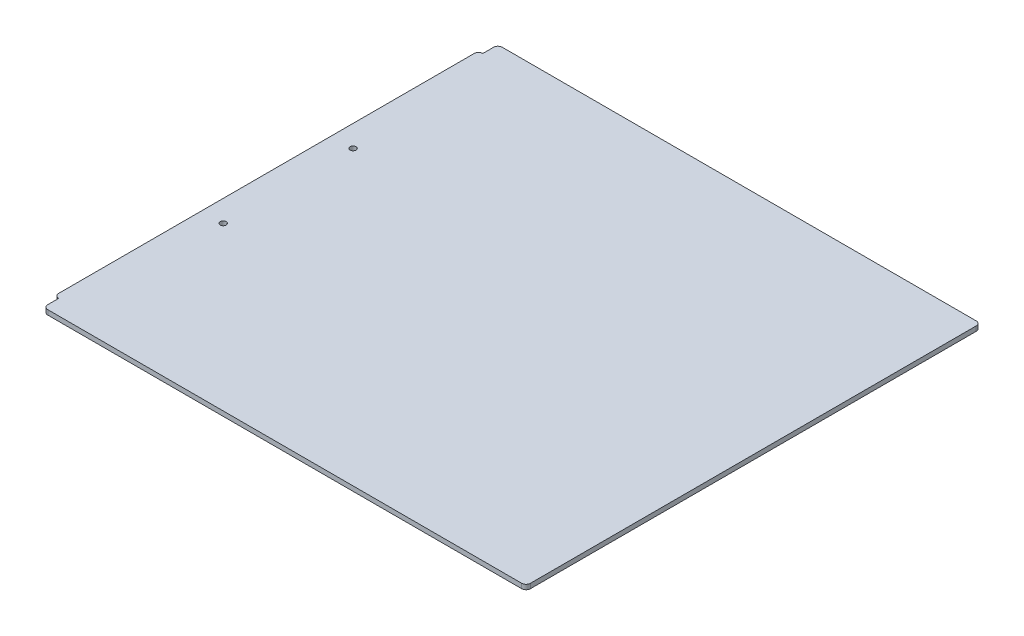
ISO-10303-21;
HEADER;
FILE_DESCRIPTION(('STEP AP214'),'2;1');
FILE_NAME('part.step','',(''),(''),'','','');
FILE_SCHEMA(('AUTOMOTIVE_DESIGN { 1 0 10303 214 1 1 1 1 }'));
ENDSEC;
DATA;
#1=APPLICATION_CONTEXT('core data for automotive mechanical design processes');
#2=APPLICATION_PROTOCOL_DEFINITION('international standard','automotive_design',2000,#1);
#3=PRODUCT_CONTEXT('',#1,'mechanical');
#4=PRODUCT('Part','Part','',(#3));
#5=PRODUCT_RELATED_PRODUCT_CATEGORY('part','',(#4));
#6=PRODUCT_DEFINITION_FORMATION('','',#4);
#7=PRODUCT_DEFINITION_CONTEXT('part definition',#1,'design');
#8=PRODUCT_DEFINITION('design','',#6,#7);
#9=PRODUCT_DEFINITION_SHAPE('','',#8);
#10=(LENGTH_UNIT() NAMED_UNIT(*) SI_UNIT(.MILLI.,.METRE.));
#11=(NAMED_UNIT(*) PLANE_ANGLE_UNIT() SI_UNIT($,.RADIAN.));
#12=(NAMED_UNIT(*) SI_UNIT($,.STERADIAN.) SOLID_ANGLE_UNIT());
#13=UNCERTAINTY_MEASURE_WITH_UNIT(LENGTH_MEASURE(1.E-05),#10,'distance_accuracy_value','');
#14=(GEOMETRIC_REPRESENTATION_CONTEXT(3) GLOBAL_UNCERTAINTY_ASSIGNED_CONTEXT((#13)) GLOBAL_UNIT_ASSIGNED_CONTEXT((#10,
#11,#12)) REPRESENTATION_CONTEXT('',''));
#15=CARTESIAN_POINT('',(0.,0.,0.));
#16=DIRECTION('',(0.,0.,1.));
#17=DIRECTION('',(1.,0.,0.));
#18=AXIS2_PLACEMENT_3D('',#15,#16,#17);
#19=CARTESIAN_POINT('',(0.,2.778125,0.));
#20=DIRECTION('',(1.,0.,0.));
#21=DIRECTION('',(0.,0.,-1.));
#22=AXIS2_PLACEMENT_3D('',#19,#20,#21);
#23=PLANE('',#22);
#24=DIRECTION('',(0.,0.,1.));
#25=VECTOR('',#24,1.);
#26=CARTESIAN_POINT('',(0.,2.778125,0.));
#27=LINE('',#26,#25);
#28=CARTESIAN_POINT('',(0.,2.778125,-274.32));
#29=VERTEX_POINT('',#28);
#30=CARTESIAN_POINT('',(0.,2.778125,-30.48));
#31=VERTEX_POINT('',#30);
#32=EDGE_CURVE('E188',#29,#31,#27,.T.);
#33=ORIENTED_EDGE('',*,*,#32,.F.);
#34=DIRECTION('',(0.,1.,0.));
#35=VECTOR('',#34,1.);
#36=CARTESIAN_POINT('',(0.,2.778125,-274.32));
#37=LINE('',#36,#35);
#38=CARTESIAN_POINT('',(0.,0.,-274.32));
#39=VERTEX_POINT('',#38);
#40=EDGE_CURVE('E206',#29,#39,#37,.F.);
#41=ORIENTED_EDGE('',*,*,#40,.T.);
#42=DIRECTION('',(0.,0.,1.));
#43=VECTOR('',#42,1.);
#44=CARTESIAN_POINT('',(0.,0.,0.));
#45=LINE('',#44,#43);
#46=CARTESIAN_POINT('',(0.,0.,-30.48));
#47=VERTEX_POINT('',#46);
#48=EDGE_CURVE('E130',#39,#47,#45,.T.);
#49=ORIENTED_EDGE('',*,*,#48,.T.);
#50=DIRECTION('',(0.,1.,0.));
#51=VECTOR('',#50,1.);
#52=CARTESIAN_POINT('',(0.,2.778125,-30.48));
#53=LINE('',#52,#51);
#54=EDGE_CURVE('E203',#47,#31,#53,.T.);
#55=ORIENTED_EDGE('',*,*,#54,.T.);
#56=EDGE_LOOP('',(#33,#41,#49,#55));
#57=FACE_BOUND('',#56,.T.);
#58=ADVANCED_FACE('F33',(#57),#23,.F.);
#59=CARTESIAN_POINT('',(0.,2.778125,0.));
#60=DIRECTION('',(0.,-1.,0.));
#61=DIRECTION('',(0.,0.,-1.));
#62=AXIS2_PLACEMENT_3D('',#59,#60,#61);
#63=PLANE('',#62);
#64=CARTESIAN_POINT('',(12.7,2.778125,-190.5762));
#65=DIRECTION('',(0.,1.,0.));
#66=DIRECTION('',(0.,0.,1.));
#67=AXIS2_PLACEMENT_3D('',#64,#65,#66);
#68=CIRCLE('',#67,1.7526);
#69=CARTESIAN_POINT('',(12.7,2.778125,-188.8236));
#70=VERTEX_POINT('',#69);
#71=EDGE_CURVE('E171',#70,#70,#68,.T.);
#72=ORIENTED_EDGE('',*,*,#71,.F.);
#73=EDGE_LOOP('',(#72));
#74=FACE_BOUND('',#73,.T.);
#75=CARTESIAN_POINT('',(12.7,2.778125,-114.3762));
#76=DIRECTION('',(0.,1.,0.));
#77=DIRECTION('',(0.,0.,1.));
#78=AXIS2_PLACEMENT_3D('',#75,#76,#77);
#79=CIRCLE('',#78,1.7526);
#80=CARTESIAN_POINT('',(12.7,2.778125,-112.6236));
#81=VERTEX_POINT('',#80);
#82=EDGE_CURVE('E165',#81,#81,#79,.T.);
#83=ORIENTED_EDGE('',*,*,#82,.F.);
#84=EDGE_LOOP('',(#83));
#85=FACE_BOUND('',#84,.T.);
#86=DIRECTION('',(0.,0.,-1.));
#87=VECTOR('',#86,1.);
#88=CARTESIAN_POINT('',(2.54,2.778125,-285.75));
#89=LINE('',#88,#87);
#90=CARTESIAN_POINT('',(2.54,2.778125,-276.86));
#91=VERTEX_POINT('',#90);
#92=CARTESIAN_POINT('',(2.54,2.778125,-283.21));
#93=VERTEX_POINT('',#92);
#94=EDGE_CURVE('E145',#91,#93,#89,.T.);
#95=ORIENTED_EDGE('',*,*,#94,.F.);
#96=CARTESIAN_POINT('',(2.54,2.778125,-274.32));
#97=DIRECTION('',(0.,-1.,0.));
#98=DIRECTION('',(0.,0.,-1.));
#99=AXIS2_PLACEMENT_3D('',#96,#97,#98);
#100=CIRCLE('',#99,2.54);
#101=EDGE_CURVE('E148',#91,#29,#100,.F.);
#102=ORIENTED_EDGE('',*,*,#101,.T.);
#103=ORIENTED_EDGE('',*,*,#32,.T.);
#104=CARTESIAN_POINT('',(2.54,2.778125,-30.48));
#105=DIRECTION('',(0.,-1.,0.));
#106=DIRECTION('',(0.,0.,-1.));
#107=AXIS2_PLACEMENT_3D('',#104,#105,#106);
#108=CIRCLE('',#107,2.54);
#109=CARTESIAN_POINT('',(2.54000000000003,2.778125,-27.94));
#110=VERTEX_POINT('',#109);
#111=EDGE_CURVE('E196',#31,#110,#108,.F.);
#112=ORIENTED_EDGE('',*,*,#111,.T.);
#113=DIRECTION('',(0.,0.,-1.));
#114=VECTOR('',#113,1.);
#115=CARTESIAN_POINT('',(2.54,2.778125,-19.05));
#116=LINE('',#115,#114);
#117=CARTESIAN_POINT('',(2.54000000000001,2.778125,-21.59));
#118=VERTEX_POINT('',#117);
#119=EDGE_CURVE('E159',#118,#110,#116,.T.);
#120=ORIENTED_EDGE('',*,*,#119,.F.);
#121=CARTESIAN_POINT('',(5.08000000000001,2.778125,-21.59));
#122=DIRECTION('',(0.,-1.,0.));
#123=DIRECTION('',(0.,0.,-1.));
#124=AXIS2_PLACEMENT_3D('',#121,#122,#123);
#125=CIRCLE('',#124,2.54);
#126=CARTESIAN_POINT('',(5.08000000000001,2.778125,-19.05));
#127=VERTEX_POINT('',#126);
#128=EDGE_CURVE('E198',#118,#127,#125,.F.);
#129=ORIENTED_EDGE('',*,*,#128,.T.);
#130=DIRECTION('',(-1.,0.,0.));
#131=VECTOR('',#130,1.);
#132=CARTESIAN_POINT('',(0.,2.778125,-19.05));
#133=LINE('',#132,#131);
#134=CARTESIAN_POINT('',(283.21,2.778125,-19.05));
#135=VERTEX_POINT('',#134);
#136=EDGE_CURVE('E181',#135,#127,#133,.T.);
#137=ORIENTED_EDGE('',*,*,#136,.F.);
#138=CARTESIAN_POINT('',(283.21,2.778125,-21.59));
#139=DIRECTION('',(0.,-1.,0.));
#140=DIRECTION('',(0.,0.,-1.));
#141=AXIS2_PLACEMENT_3D('',#138,#139,#140);
#142=CIRCLE('',#141,2.54);
#143=CARTESIAN_POINT('',(285.75,2.778125,-21.59));
#144=VERTEX_POINT('',#143);
#145=EDGE_CURVE('E194',#135,#144,#142,.F.);
#146=ORIENTED_EDGE('',*,*,#145,.T.);
#147=DIRECTION('',(0.,0.,1.));
#148=VECTOR('',#147,1.);
#149=CARTESIAN_POINT('',(285.75,2.778125,-285.75));
#150=LINE('',#149,#148);
#151=CARTESIAN_POINT('',(285.75,2.778125,-283.21));
#152=VERTEX_POINT('',#151);
#153=EDGE_CURVE('E149',#152,#144,#150,.T.);
#154=ORIENTED_EDGE('',*,*,#153,.F.);
#155=CARTESIAN_POINT('',(283.21,2.778125,-283.21));
#156=DIRECTION('',(0.,-1.,0.));
#157=DIRECTION('',(0.,0.,-1.));
#158=AXIS2_PLACEMENT_3D('',#155,#156,#157);
#159=CIRCLE('',#158,2.54);
#160=CARTESIAN_POINT('',(283.21,2.778125,-285.75));
#161=VERTEX_POINT('',#160);
#162=EDGE_CURVE('E191',#152,#161,#159,.F.);
#163=ORIENTED_EDGE('',*,*,#162,.T.);
#164=DIRECTION('',(1.,0.,0.));
#165=VECTOR('',#164,1.);
#166=CARTESIAN_POINT('',(0.,2.778125,-285.75));
#167=LINE('',#166,#165);
#168=CARTESIAN_POINT('',(5.08,2.778125,-285.75));
#169=VERTEX_POINT('',#168);
#170=EDGE_CURVE('E170',#169,#161,#167,.T.);
#171=ORIENTED_EDGE('',*,*,#170,.F.);
#172=CARTESIAN_POINT('',(5.08,2.778125,-283.21));
#173=DIRECTION('',(0.,-1.,0.));
#174=DIRECTION('',(0.,0.,-1.));
#175=AXIS2_PLACEMENT_3D('',#172,#173,#174);
#176=CIRCLE('',#175,2.54);
#177=EDGE_CURVE('E200',#169,#93,#176,.F.);
#178=ORIENTED_EDGE('',*,*,#177,.T.);
#179=EDGE_LOOP('',(#95,#102,#103,#112,#120,#129,#137,#146,#154,#163,#171,#178));
#180=FACE_BOUND('',#179,.T.);
#181=ADVANCED_FACE('F237',(#74,#85,#180),#63,.F.);
#182=CARTESIAN_POINT('',(0.,0.,0.));
#183=DIRECTION('',(0.,-1.,0.));
#184=DIRECTION('',(0.,0.,-1.));
#185=AXIS2_PLACEMENT_3D('',#182,#183,#184);
#186=PLANE('',#185);
#187=ORIENTED_EDGE('',*,*,#48,.F.);
#188=CARTESIAN_POINT('',(2.54,0.,-274.32));
#189=DIRECTION('',(0.,-1.,0.));
#190=DIRECTION('',(0.,0.,-1.));
#191=AXIS2_PLACEMENT_3D('',#188,#189,#190);
#192=CIRCLE('',#191,2.54);
#193=CARTESIAN_POINT('',(2.54,0.,-276.86));
#194=VERTEX_POINT('',#193);
#195=EDGE_CURVE('E123',#39,#194,#192,.T.);
#196=ORIENTED_EDGE('',*,*,#195,.T.);
#197=DIRECTION('',(0.,0.,-1.));
#198=VECTOR('',#197,1.);
#199=CARTESIAN_POINT('',(2.54,0.,-285.75));
#200=LINE('',#199,#198);
#201=CARTESIAN_POINT('',(2.54,0.,-283.21));
#202=VERTEX_POINT('',#201);
#203=EDGE_CURVE('E127',#194,#202,#200,.T.);
#204=ORIENTED_EDGE('',*,*,#203,.T.);
#205=CARTESIAN_POINT('',(5.08,0.,-283.21));
#206=DIRECTION('',(0.,-1.,0.));
#207=DIRECTION('',(0.,0.,-1.));
#208=AXIS2_PLACEMENT_3D('',#205,#206,#207);
#209=CIRCLE('',#208,2.54);
#210=CARTESIAN_POINT('',(5.08,0.,-285.75));
#211=VERTEX_POINT('',#210);
#212=EDGE_CURVE('E135',#202,#211,#209,.T.);
#213=ORIENTED_EDGE('',*,*,#212,.T.);
#214=DIRECTION('',(1.,0.,0.));
#215=VECTOR('',#214,1.);
#216=CARTESIAN_POINT('',(0.,0.,-285.75));
#217=LINE('',#216,#215);
#218=CARTESIAN_POINT('',(283.21,0.,-285.75));
#219=VERTEX_POINT('',#218);
#220=EDGE_CURVE('E183',#211,#219,#217,.T.);
#221=ORIENTED_EDGE('',*,*,#220,.T.);
#222=CARTESIAN_POINT('',(283.21,0.,-283.21));
#223=DIRECTION('',(0.,-1.,0.));
#224=DIRECTION('',(0.,0.,-1.));
#225=AXIS2_PLACEMENT_3D('',#222,#223,#224);
#226=CIRCLE('',#225,2.54);
#227=CARTESIAN_POINT('',(285.75,0.,-283.21));
#228=VERTEX_POINT('',#227);
#229=EDGE_CURVE('E208',#219,#228,#226,.T.);
#230=ORIENTED_EDGE('',*,*,#229,.T.);
#231=DIRECTION('',(0.,0.,1.));
#232=VECTOR('',#231,1.);
#233=CARTESIAN_POINT('',(285.75,0.,-285.75));
#234=LINE('',#233,#232);
#235=CARTESIAN_POINT('',(285.75,0.,-21.59));
#236=VERTEX_POINT('',#235);
#237=EDGE_CURVE('E152',#228,#236,#234,.T.);
#238=ORIENTED_EDGE('',*,*,#237,.T.);
#239=CARTESIAN_POINT('',(283.21,0.,-21.59));
#240=DIRECTION('',(0.,-1.,0.));
#241=DIRECTION('',(0.,0.,-1.));
#242=AXIS2_PLACEMENT_3D('',#239,#240,#241);
#243=CIRCLE('',#242,2.54);
#244=CARTESIAN_POINT('',(283.21,0.,-19.05));
#245=VERTEX_POINT('',#244);
#246=EDGE_CURVE('E210',#236,#245,#243,.T.);
#247=ORIENTED_EDGE('',*,*,#246,.T.);
#248=DIRECTION('',(-1.,0.,0.));
#249=VECTOR('',#248,1.);
#250=CARTESIAN_POINT('',(0.,0.,-19.05));
#251=LINE('',#250,#249);
#252=CARTESIAN_POINT('',(5.08000000000001,0.,-19.05));
#253=VERTEX_POINT('',#252);
#254=EDGE_CURVE('E179',#245,#253,#251,.T.);
#255=ORIENTED_EDGE('',*,*,#254,.T.);
#256=CARTESIAN_POINT('',(5.08000000000001,0.,-21.59));
#257=DIRECTION('',(0.,-1.,0.));
#258=DIRECTION('',(0.,0.,-1.));
#259=AXIS2_PLACEMENT_3D('',#256,#257,#258);
#260=CIRCLE('',#259,2.54);
#261=CARTESIAN_POINT('',(2.54000000000001,0.,-21.59));
#262=VERTEX_POINT('',#261);
#263=EDGE_CURVE('E48',#253,#262,#260,.T.);
#264=ORIENTED_EDGE('',*,*,#263,.T.);
#265=DIRECTION('',(0.,0.,-1.));
#266=VECTOR('',#265,1.);
#267=CARTESIAN_POINT('',(2.54,0.,-19.05));
#268=LINE('',#267,#266);
#269=CARTESIAN_POINT('',(2.54000000000003,0.,-27.94));
#270=VERTEX_POINT('',#269);
#271=EDGE_CURVE('E156',#262,#270,#268,.T.);
#272=ORIENTED_EDGE('',*,*,#271,.T.);
#273=CARTESIAN_POINT('',(2.54,0.,-30.48));
#274=DIRECTION('',(0.,-1.,0.));
#275=DIRECTION('',(0.,0.,-1.));
#276=AXIS2_PLACEMENT_3D('',#273,#274,#275);
#277=CIRCLE('',#276,2.54);
#278=EDGE_CURVE('E212',#270,#47,#277,.T.);
#279=ORIENTED_EDGE('',*,*,#278,.T.);
#280=EDGE_LOOP('',(#187,#196,#204,#213,#221,#230,#238,#247,#255,#264,#272,#279));
#281=FACE_BOUND('',#280,.T.);
#282=CARTESIAN_POINT('',(12.7,0.,-190.5762));
#283=DIRECTION('',(0.,1.,0.));
#284=DIRECTION('',(0.,0.,1.));
#285=AXIS2_PLACEMENT_3D('',#282,#283,#284);
#286=CIRCLE('',#285,1.7526);
#287=CARTESIAN_POINT('',(12.7,0.,-188.8236));
#288=VERTEX_POINT('',#287);
#289=EDGE_CURVE('E167',#288,#288,#286,.T.);
#290=ORIENTED_EDGE('',*,*,#289,.T.);
#291=EDGE_LOOP('',(#290));
#292=FACE_BOUND('',#291,.T.);
#293=CARTESIAN_POINT('',(12.7,0.,-114.3762));
#294=DIRECTION('',(0.,1.,0.));
#295=DIRECTION('',(0.,0.,1.));
#296=AXIS2_PLACEMENT_3D('',#293,#294,#295);
#297=CIRCLE('',#296,1.7526);
#298=CARTESIAN_POINT('',(12.7,0.,-112.6236));
#299=VERTEX_POINT('',#298);
#300=EDGE_CURVE('E174',#299,#299,#297,.T.);
#301=ORIENTED_EDGE('',*,*,#300,.T.);
#302=EDGE_LOOP('',(#301));
#303=FACE_BOUND('',#302,.T.);
#304=ADVANCED_FACE('F125',(#281,#292,#303),#186,.T.);
#305=CARTESIAN_POINT('',(0.,0.,-285.75));
#306=DIRECTION('',(0.,0.,1.));
#307=DIRECTION('',(1.,0.,0.));
#308=AXIS2_PLACEMENT_3D('',#305,#306,#307);
#309=PLANE('',#308);
#310=ORIENTED_EDGE('',*,*,#220,.F.);
#311=DIRECTION('',(0.,1.,0.));
#312=VECTOR('',#311,1.);
#313=CARTESIAN_POINT('',(5.08,0.,-285.75));
#314=LINE('',#313,#312);
#315=EDGE_CURVE('E217',#211,#169,#314,.T.);
#316=ORIENTED_EDGE('',*,*,#315,.T.);
#317=ORIENTED_EDGE('',*,*,#170,.T.);
#318=DIRECTION('',(0.,1.,0.));
#319=VECTOR('',#318,1.);
#320=CARTESIAN_POINT('',(283.21,0.,-285.75));
#321=LINE('',#320,#319);
#322=EDGE_CURVE('E134',#161,#219,#321,.F.);
#323=ORIENTED_EDGE('',*,*,#322,.T.);
#324=EDGE_LOOP('',(#310,#316,#317,#323));
#325=FACE_BOUND('',#324,.T.);
#326=ADVANCED_FACE('F287',(#325),#309,.F.);
#327=CARTESIAN_POINT('',(0.,0.,-19.05));
#328=DIRECTION('',(0.,0.,-1.));
#329=DIRECTION('',(-1.,0.,0.));
#330=AXIS2_PLACEMENT_3D('',#327,#328,#329);
#331=PLANE('',#330);
#332=ORIENTED_EDGE('',*,*,#136,.T.);
#333=DIRECTION('',(0.,1.,0.));
#334=VECTOR('',#333,1.);
#335=CARTESIAN_POINT('',(5.08000000000001,0.,-19.05));
#336=LINE('',#335,#334);
#337=EDGE_CURVE('E56',#127,#253,#336,.F.);
#338=ORIENTED_EDGE('',*,*,#337,.T.);
#339=ORIENTED_EDGE('',*,*,#254,.F.);
#340=DIRECTION('',(0.,1.,0.));
#341=VECTOR('',#340,1.);
#342=CARTESIAN_POINT('',(283.21,0.,-19.05));
#343=LINE('',#342,#341);
#344=EDGE_CURVE('E224',#245,#135,#343,.T.);
#345=ORIENTED_EDGE('',*,*,#344,.T.);
#346=EDGE_LOOP('',(#332,#338,#339,#345));
#347=FACE_BOUND('',#346,.T.);
#348=ADVANCED_FACE('F244',(#347),#331,.F.);
#349=CARTESIAN_POINT('',(12.7,0.,-114.3762));
#350=DIRECTION('',(0.,1.,0.));
#351=DIRECTION('',(0.,0.,1.));
#352=AXIS2_PLACEMENT_3D('',#349,#350,#351);
#353=CYLINDRICAL_SURFACE('',#352,1.7526);
#354=ORIENTED_EDGE('',*,*,#300,.F.);
#355=EDGE_LOOP('',(#354));
#356=FACE_BOUND('',#355,.T.);
#357=ORIENTED_EDGE('',*,*,#82,.T.);
#358=EDGE_LOOP('',(#357));
#359=FACE_BOUND('',#358,.T.);
#360=ADVANCED_FACE('F294',(#356,#359),#353,.F.);
#361=CARTESIAN_POINT('',(12.7,0.,-190.5762));
#362=DIRECTION('',(0.,1.,0.));
#363=DIRECTION('',(0.,0.,1.));
#364=AXIS2_PLACEMENT_3D('',#361,#362,#363);
#365=CYLINDRICAL_SURFACE('',#364,1.7526);
#366=ORIENTED_EDGE('',*,*,#289,.F.);
#367=EDGE_LOOP('',(#366));
#368=FACE_BOUND('',#367,.T.);
#369=ORIENTED_EDGE('',*,*,#71,.T.);
#370=EDGE_LOOP('',(#369));
#371=FACE_BOUND('',#370,.T.);
#372=ADVANCED_FACE('F300',(#368,#371),#365,.F.);
#373=CARTESIAN_POINT('',(285.75,0.,-285.75));
#374=DIRECTION('',(-1.,0.,0.));
#375=DIRECTION('',(0.,0.,1.));
#376=AXIS2_PLACEMENT_3D('',#373,#374,#375);
#377=PLANE('',#376);
#378=ORIENTED_EDGE('',*,*,#153,.T.);
#379=DIRECTION('',(0.,1.,0.));
#380=VECTOR('',#379,1.);
#381=CARTESIAN_POINT('',(285.75,0.,-21.59));
#382=LINE('',#381,#380);
#383=EDGE_CURVE('E11',#144,#236,#382,.F.);
#384=ORIENTED_EDGE('',*,*,#383,.T.);
#385=ORIENTED_EDGE('',*,*,#237,.F.);
#386=DIRECTION('',(0.,1.,0.));
#387=VECTOR('',#386,1.);
#388=CARTESIAN_POINT('',(285.75,0.,-283.21));
#389=LINE('',#388,#387);
#390=EDGE_CURVE('E41',#228,#152,#389,.T.);
#391=ORIENTED_EDGE('',*,*,#390,.T.);
#392=EDGE_LOOP('',(#378,#384,#385,#391));
#393=FACE_BOUND('',#392,.T.);
#394=ADVANCED_FACE('F232',(#393),#377,.F.);
#395=CARTESIAN_POINT('',(2.54,0.,-19.05));
#396=DIRECTION('',(1.,0.,0.));
#397=DIRECTION('',(0.,0.,-1.));
#398=AXIS2_PLACEMENT_3D('',#395,#396,#397);
#399=PLANE('',#398);
#400=ORIENTED_EDGE('',*,*,#271,.F.);
#401=DIRECTION('',(0.,1.,0.));
#402=VECTOR('',#401,1.);
#403=CARTESIAN_POINT('',(2.54000000000001,0.,-21.59));
#404=LINE('',#403,#402);
#405=EDGE_CURVE('E221',#262,#118,#404,.T.);
#406=ORIENTED_EDGE('',*,*,#405,.T.);
#407=ORIENTED_EDGE('',*,*,#119,.T.);
#408=DIRECTION('',(0.,1.,0.));
#409=VECTOR('',#408,1.);
#410=CARTESIAN_POINT('',(2.54000000000003,0.,-27.94));
#411=LINE('',#410,#409);
#412=EDGE_CURVE('E158',#270,#110,#411,.T.);
#413=ORIENTED_EDGE('',*,*,#412,.F.);
#414=EDGE_LOOP('',(#400,#406,#407,#413));
#415=FACE_BOUND('',#414,.T.);
#416=ADVANCED_FACE('F250',(#415),#399,.F.);
#417=CARTESIAN_POINT('',(2.54,0.,-285.75));
#418=DIRECTION('',(1.,0.,0.));
#419=DIRECTION('',(0.,0.,-1.));
#420=AXIS2_PLACEMENT_3D('',#417,#418,#419);
#421=PLANE('',#420);
#422=ORIENTED_EDGE('',*,*,#94,.T.);
#423=DIRECTION('',(0.,1.,0.));
#424=VECTOR('',#423,1.);
#425=CARTESIAN_POINT('',(2.54,0.,-283.21));
#426=LINE('',#425,#424);
#427=EDGE_CURVE('E144',#93,#202,#426,.F.);
#428=ORIENTED_EDGE('',*,*,#427,.T.);
#429=ORIENTED_EDGE('',*,*,#203,.F.);
#430=DIRECTION('',(0.,1.,0.));
#431=VECTOR('',#430,1.);
#432=CARTESIAN_POINT('',(2.54,0.,-276.86));
#433=LINE('',#432,#431);
#434=EDGE_CURVE('E141',#194,#91,#433,.T.);
#435=ORIENTED_EDGE('',*,*,#434,.T.);
#436=EDGE_LOOP('',(#422,#428,#429,#435));
#437=FACE_BOUND('',#436,.T.);
#438=ADVANCED_FACE('F140',(#437),#421,.F.);
#439=CARTESIAN_POINT('',(2.54,0.,-274.32));
#440=DIRECTION('',(0.,1.,0.));
#441=DIRECTION('',(0.,0.,1.));
#442=AXIS2_PLACEMENT_3D('',#439,#440,#441);
#443=CYLINDRICAL_SURFACE('',#442,2.54);
#444=ORIENTED_EDGE('',*,*,#195,.F.);
#445=ORIENTED_EDGE('',*,*,#40,.F.);
#446=ORIENTED_EDGE('',*,*,#101,.F.);
#447=ORIENTED_EDGE('',*,*,#434,.F.);
#448=EDGE_LOOP('',(#444,#445,#446,#447));
#449=FACE_BOUND('',#448,.T.);
#450=ADVANCED_FACE('F147',(#449),#443,.T.);
#451=CARTESIAN_POINT('',(5.08,0.,-283.21));
#452=DIRECTION('',(0.,1.,0.));
#453=DIRECTION('',(0.,0.,1.));
#454=AXIS2_PLACEMENT_3D('',#451,#452,#453);
#455=CYLINDRICAL_SURFACE('',#454,2.54);
#456=ORIENTED_EDGE('',*,*,#212,.F.);
#457=ORIENTED_EDGE('',*,*,#427,.F.);
#458=ORIENTED_EDGE('',*,*,#177,.F.);
#459=ORIENTED_EDGE('',*,*,#315,.F.);
#460=EDGE_LOOP('',(#456,#457,#458,#459));
#461=FACE_BOUND('',#460,.T.);
#462=ADVANCED_FACE('F270',(#461),#455,.T.);
#463=CARTESIAN_POINT('',(5.08000000000001,0.,-21.59));
#464=DIRECTION('',(0.,1.,0.));
#465=DIRECTION('',(0.,0.,1.));
#466=AXIS2_PLACEMENT_3D('',#463,#464,#465);
#467=CYLINDRICAL_SURFACE('',#466,2.54);
#468=ORIENTED_EDGE('',*,*,#263,.F.);
#469=ORIENTED_EDGE('',*,*,#337,.F.);
#470=ORIENTED_EDGE('',*,*,#128,.F.);
#471=ORIENTED_EDGE('',*,*,#405,.F.);
#472=EDGE_LOOP('',(#468,#469,#470,#471));
#473=FACE_BOUND('',#472,.T.);
#474=ADVANCED_FACE('F247',(#473),#467,.T.);
#475=CARTESIAN_POINT('',(2.54,2.778125,-30.48));
#476=DIRECTION('',(0.,1.,0.));
#477=DIRECTION('',(0.,0.,1.));
#478=AXIS2_PLACEMENT_3D('',#475,#476,#477);
#479=CYLINDRICAL_SURFACE('',#478,2.54);
#480=ORIENTED_EDGE('',*,*,#278,.F.);
#481=ORIENTED_EDGE('',*,*,#412,.T.);
#482=ORIENTED_EDGE('',*,*,#111,.F.);
#483=ORIENTED_EDGE('',*,*,#54,.F.);
#484=EDGE_LOOP('',(#480,#481,#482,#483));
#485=FACE_BOUND('',#484,.T.);
#486=ADVANCED_FACE('F256',(#485),#479,.T.);
#487=CARTESIAN_POINT('',(283.21,0.,-21.59));
#488=DIRECTION('',(0.,1.,0.));
#489=DIRECTION('',(0.,0.,1.));
#490=AXIS2_PLACEMENT_3D('',#487,#488,#489);
#491=CYLINDRICAL_SURFACE('',#490,2.54);
#492=ORIENTED_EDGE('',*,*,#246,.F.);
#493=ORIENTED_EDGE('',*,*,#383,.F.);
#494=ORIENTED_EDGE('',*,*,#145,.F.);
#495=ORIENTED_EDGE('',*,*,#344,.F.);
#496=EDGE_LOOP('',(#492,#493,#494,#495));
#497=FACE_BOUND('',#496,.T.);
#498=ADVANCED_FACE('F243',(#497),#491,.T.);
#499=CARTESIAN_POINT('',(283.21,0.,-283.21));
#500=DIRECTION('',(0.,1.,0.));
#501=DIRECTION('',(0.,0.,1.));
#502=AXIS2_PLACEMENT_3D('',#499,#500,#501);
#503=CYLINDRICAL_SURFACE('',#502,2.54);
#504=ORIENTED_EDGE('',*,*,#229,.F.);
#505=ORIENTED_EDGE('',*,*,#322,.F.);
#506=ORIENTED_EDGE('',*,*,#162,.F.);
#507=ORIENTED_EDGE('',*,*,#390,.F.);
#508=EDGE_LOOP('',(#504,#505,#506,#507));
#509=FACE_BOUND('',#508,.T.);
#510=ADVANCED_FACE('F35',(#509),#503,.T.);
#511=CLOSED_SHELL('',(#58,#181,#304,#326,#348,#360,#372,#394,#416,#438,#450,#462,#474,#486,#498,#510));
#512=MANIFOLD_SOLID_BREP('B2',#511);
#513=ADVANCED_BREP_SHAPE_REPRESENTATION('',(#18,#512),#14);
#514=SHAPE_DEFINITION_REPRESENTATION(#9,#513);
ENDSEC;
END-ISO-10303-21;
